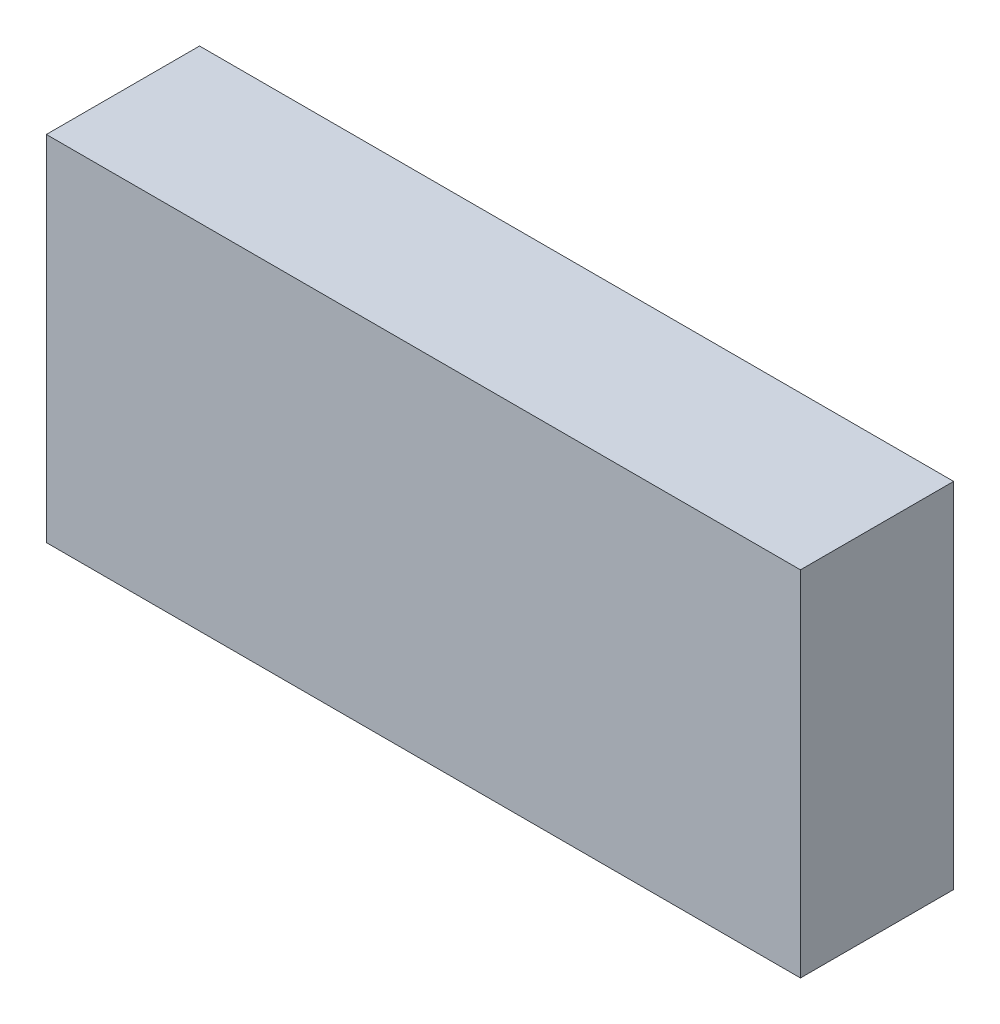
ISO-10303-21;
HEADER;
FILE_DESCRIPTION(('STEP AP214'),'2;1');
FILE_NAME('part.step','',(''),(''),'','','');
FILE_SCHEMA(('AUTOMOTIVE_DESIGN { 1 0 10303 214 1 1 1 1 }'));
ENDSEC;
DATA;
#1=APPLICATION_CONTEXT('core data for automotive mechanical design processes');
#2=APPLICATION_PROTOCOL_DEFINITION('international standard','automotive_design',2000,#1);
#3=PRODUCT_CONTEXT('',#1,'mechanical');
#4=PRODUCT('Part','Part','',(#3));
#5=PRODUCT_RELATED_PRODUCT_CATEGORY('part','',(#4));
#6=PRODUCT_DEFINITION_FORMATION('','',#4);
#7=PRODUCT_DEFINITION_CONTEXT('part definition',#1,'design');
#8=PRODUCT_DEFINITION('design','',#6,#7);
#9=PRODUCT_DEFINITION_SHAPE('','',#8);
#10=(LENGTH_UNIT() NAMED_UNIT(*) SI_UNIT(.MILLI.,.METRE.));
#11=(NAMED_UNIT(*) PLANE_ANGLE_UNIT() SI_UNIT($,.RADIAN.));
#12=(NAMED_UNIT(*) SI_UNIT($,.STERADIAN.) SOLID_ANGLE_UNIT());
#13=UNCERTAINTY_MEASURE_WITH_UNIT(LENGTH_MEASURE(1.E-05),#10,'distance_accuracy_value','');
#14=(GEOMETRIC_REPRESENTATION_CONTEXT(3) GLOBAL_UNCERTAINTY_ASSIGNED_CONTEXT((#13)) GLOBAL_UNIT_ASSIGNED_CONTEXT((#10,
#11,#12)) REPRESENTATION_CONTEXT('',''));
#15=CARTESIAN_POINT('',(0.,0.,0.));
#16=DIRECTION('',(0.,0.,1.));
#17=DIRECTION('',(1.,0.,0.));
#18=AXIS2_PLACEMENT_3D('',#15,#16,#17);
#19=CARTESIAN_POINT('',(-1.59999934,0.75000104,0.65000124));
#20=DIRECTION('',(0.,0.,1.));
#21=DIRECTION('',(1.,0.,0.));
#22=AXIS2_PLACEMENT_3D('',#19,#20,#21);
#23=PLANE('',#22);
#24=DIRECTION('',(0.,1.,0.));
#25=VECTOR('',#24,1.);
#26=CARTESIAN_POINT('',(1.59999934,0.75000104,0.65000124));
#27=LINE('',#26,#25);
#28=CARTESIAN_POINT('',(1.59999934,0.75000104,0.65000124));
#29=VERTEX_POINT('',#28);
#30=CARTESIAN_POINT('',(1.59999934,-0.75000104,0.65000124));
#31=VERTEX_POINT('',#30);
#32=EDGE_CURVE('E53',#29,#31,#27,.F.);
#33=ORIENTED_EDGE('',*,*,#32,.F.);
#34=DIRECTION('',(1.,0.,0.));
#35=VECTOR('',#34,1.);
#36=CARTESIAN_POINT('',(-1.59999934,0.75000104,0.65000124));
#37=LINE('',#36,#35);
#38=CARTESIAN_POINT('',(-1.59999934,0.75000104,0.65000124));
#39=VERTEX_POINT('',#38);
#40=EDGE_CURVE('E68',#39,#29,#37,.T.);
#41=ORIENTED_EDGE('',*,*,#40,.F.);
#42=DIRECTION('',(0.,1.,0.));
#43=VECTOR('',#42,1.);
#44=CARTESIAN_POINT('',(-1.59999934,-0.75000104,0.65000124));
#45=LINE('',#44,#43);
#46=CARTESIAN_POINT('',(-1.59999934,-0.75000104,0.65000124));
#47=VERTEX_POINT('',#46);
#48=EDGE_CURVE('E20',#47,#39,#45,.T.);
#49=ORIENTED_EDGE('',*,*,#48,.F.);
#50=DIRECTION('',(1.,0.,0.));
#51=VECTOR('',#50,1.);
#52=CARTESIAN_POINT('',(1.59999934,-0.75000104,0.65000124));
#53=LINE('',#52,#51);
#54=EDGE_CURVE('E58',#31,#47,#53,.F.);
#55=ORIENTED_EDGE('',*,*,#54,.F.);
#56=EDGE_LOOP('',(#33,#41,#49,#55));
#57=FACE_BOUND('',#56,.T.);
#58=ADVANCED_FACE('F17',(#57),#23,.T.);
#59=CARTESIAN_POINT('',(-1.59999934,-0.75000104,0.));
#60=DIRECTION('',(-1.,0.,0.));
#61=DIRECTION('',(0.,0.,1.));
#62=AXIS2_PLACEMENT_3D('',#59,#60,#61);
#63=PLANE('',#62);
#64=DIRECTION('',(0.,0.,1.));
#65=VECTOR('',#64,1.);
#66=CARTESIAN_POINT('',(-1.59999934,0.75000104,0.));
#67=LINE('',#66,#65);
#68=CARTESIAN_POINT('',(-1.59999934,0.75000104,0.));
#69=VERTEX_POINT('',#68);
#70=EDGE_CURVE('E79',#69,#39,#67,.T.);
#71=ORIENTED_EDGE('',*,*,#70,.F.);
#72=DIRECTION('',(0.,1.,0.));
#73=VECTOR('',#72,1.);
#74=CARTESIAN_POINT('',(-1.59999934,0.75000104,0.));
#75=LINE('',#74,#73);
#76=CARTESIAN_POINT('',(-1.59999934,-0.75000104,0.));
#77=VERTEX_POINT('',#76);
#78=EDGE_CURVE('E74',#69,#77,#75,.F.);
#79=ORIENTED_EDGE('',*,*,#78,.T.);
#80=DIRECTION('',(0.,0.,-1.));
#81=VECTOR('',#80,1.);
#82=CARTESIAN_POINT('',(-1.59999934,-0.75000104,0.));
#83=LINE('',#82,#81);
#84=EDGE_CURVE('E63',#47,#77,#83,.T.);
#85=ORIENTED_EDGE('',*,*,#84,.F.);
#86=ORIENTED_EDGE('',*,*,#48,.T.);
#87=EDGE_LOOP('',(#71,#79,#85,#86));
#88=FACE_BOUND('',#87,.T.);
#89=ADVANCED_FACE('F73',(#88),#63,.T.);
#90=CARTESIAN_POINT('',(1.59999934,-0.75000104,0.));
#91=DIRECTION('',(0.,-1.,0.));
#92=DIRECTION('',(0.,0.,-1.));
#93=AXIS2_PLACEMENT_3D('',#90,#91,#92);
#94=PLANE('',#93);
#95=ORIENTED_EDGE('',*,*,#84,.T.);
#96=DIRECTION('',(1.,0.,0.));
#97=VECTOR('',#96,1.);
#98=CARTESIAN_POINT('',(-1.59999934,-0.75000104,0.));
#99=LINE('',#98,#97);
#100=CARTESIAN_POINT('',(1.59999934,-0.75000104,0.));
#101=VERTEX_POINT('',#100);
#102=EDGE_CURVE('E84',#77,#101,#99,.T.);
#103=ORIENTED_EDGE('',*,*,#102,.T.);
#104=DIRECTION('',(0.,0.,-1.));
#105=VECTOR('',#104,1.);
#106=CARTESIAN_POINT('',(1.59999934,-0.75000104,0.));
#107=LINE('',#106,#105);
#108=EDGE_CURVE('E65',#31,#101,#107,.T.);
#109=ORIENTED_EDGE('',*,*,#108,.F.);
#110=ORIENTED_EDGE('',*,*,#54,.T.);
#111=EDGE_LOOP('',(#95,#103,#109,#110));
#112=FACE_BOUND('',#111,.T.);
#113=ADVANCED_FACE('F60',(#112),#94,.T.);
#114=CARTESIAN_POINT('',(1.59999934,0.75000104,0.));
#115=DIRECTION('',(1.,0.,0.));
#116=DIRECTION('',(0.,0.,-1.));
#117=AXIS2_PLACEMENT_3D('',#114,#115,#116);
#118=PLANE('',#117);
#119=ORIENTED_EDGE('',*,*,#108,.T.);
#120=DIRECTION('',(0.,1.,0.));
#121=VECTOR('',#120,1.);
#122=CARTESIAN_POINT('',(1.59999934,0.75000104,0.));
#123=LINE('',#122,#121);
#124=CARTESIAN_POINT('',(1.59999934,0.75000104,0.));
#125=VERTEX_POINT('',#124);
#126=EDGE_CURVE('E26',#101,#125,#123,.T.);
#127=ORIENTED_EDGE('',*,*,#126,.T.);
#128=DIRECTION('',(0.,0.,1.));
#129=VECTOR('',#128,1.);
#130=CARTESIAN_POINT('',(1.59999934,0.75000104,0.));
#131=LINE('',#130,#129);
#132=EDGE_CURVE('E34',#29,#125,#131,.F.);
#133=ORIENTED_EDGE('',*,*,#132,.F.);
#134=ORIENTED_EDGE('',*,*,#32,.T.);
#135=EDGE_LOOP('',(#119,#127,#133,#134));
#136=FACE_BOUND('',#135,.T.);
#137=ADVANCED_FACE('F88',(#136),#118,.T.);
#138=CARTESIAN_POINT('',(-1.59999934,0.75000104,0.));
#139=DIRECTION('',(0.,1.,0.));
#140=DIRECTION('',(0.,0.,1.));
#141=AXIS2_PLACEMENT_3D('',#138,#139,#140);
#142=PLANE('',#141);
#143=ORIENTED_EDGE('',*,*,#132,.T.);
#144=DIRECTION('',(1.,0.,0.));
#145=VECTOR('',#144,1.);
#146=CARTESIAN_POINT('',(-1.59999934,0.75000104,0.));
#147=LINE('',#146,#145);
#148=EDGE_CURVE('E11',#125,#69,#147,.F.);
#149=ORIENTED_EDGE('',*,*,#148,.T.);
#150=ORIENTED_EDGE('',*,*,#70,.T.);
#151=ORIENTED_EDGE('',*,*,#40,.T.);
#152=EDGE_LOOP('',(#143,#149,#150,#151));
#153=FACE_BOUND('',#152,.T.);
#154=ADVANCED_FACE('F91',(#153),#142,.T.);
#155=CARTESIAN_POINT('',(-1.59999934,0.75000104,0.));
#156=DIRECTION('',(0.,0.,1.));
#157=DIRECTION('',(1.,0.,0.));
#158=AXIS2_PLACEMENT_3D('',#155,#156,#157);
#159=PLANE('',#158);
#160=ORIENTED_EDGE('',*,*,#126,.F.);
#161=ORIENTED_EDGE('',*,*,#102,.F.);
#162=ORIENTED_EDGE('',*,*,#78,.F.);
#163=ORIENTED_EDGE('',*,*,#148,.F.);
#164=EDGE_LOOP('',(#160,#161,#162,#163));
#165=FACE_BOUND('',#164,.T.);
#166=ADVANCED_FACE('F90',(#165),#159,.F.);
#167=CLOSED_SHELL('',(#58,#89,#113,#137,#154,#166));
#168=MANIFOLD_SOLID_BREP('B1',#167);
#169=ADVANCED_BREP_SHAPE_REPRESENTATION('',(#18,#168),#14);
#170=SHAPE_DEFINITION_REPRESENTATION(#9,#169);
ENDSEC;
END-ISO-10303-21;
